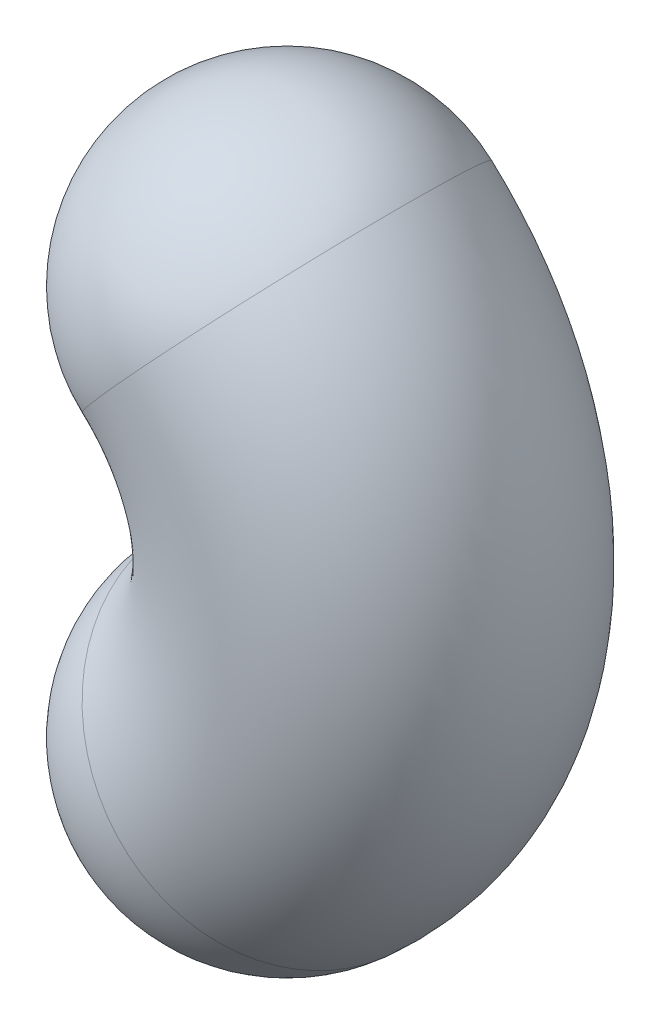
ISO-10303-21;
HEADER;
FILE_DESCRIPTION(('STEP AP214'),'2;1');
FILE_NAME('part.step','',(''),(''),'','','');
FILE_SCHEMA(('AUTOMOTIVE_DESIGN { 1 0 10303 214 1 1 1 1 }'));
ENDSEC;
DATA;
#1=APPLICATION_CONTEXT('core data for automotive mechanical design processes');
#2=APPLICATION_PROTOCOL_DEFINITION('international standard','automotive_design',2000,#1);
#3=PRODUCT_CONTEXT('',#1,'mechanical');
#4=PRODUCT('Part','Part','',(#3));
#5=PRODUCT_RELATED_PRODUCT_CATEGORY('part','',(#4));
#6=PRODUCT_DEFINITION_FORMATION('','',#4);
#7=PRODUCT_DEFINITION_CONTEXT('part definition',#1,'design');
#8=PRODUCT_DEFINITION('design','',#6,#7);
#9=PRODUCT_DEFINITION_SHAPE('','',#8);
#10=(LENGTH_UNIT() NAMED_UNIT(*) SI_UNIT(.MILLI.,.METRE.));
#11=(NAMED_UNIT(*) PLANE_ANGLE_UNIT() SI_UNIT($,.RADIAN.));
#12=(NAMED_UNIT(*) SI_UNIT($,.STERADIAN.) SOLID_ANGLE_UNIT());
#13=UNCERTAINTY_MEASURE_WITH_UNIT(LENGTH_MEASURE(1.E-05),#10,'distance_accuracy_value','');
#14=(GEOMETRIC_REPRESENTATION_CONTEXT(3) GLOBAL_UNCERTAINTY_ASSIGNED_CONTEXT((#13)) GLOBAL_UNIT_ASSIGNED_CONTEXT((#10,
#11,#12)) REPRESENTATION_CONTEXT('',''));
#15=CARTESIAN_POINT('',(0.,0.,0.));
#16=DIRECTION('',(0.,0.,1.));
#17=DIRECTION('',(1.,0.,0.));
#18=AXIS2_PLACEMENT_3D('',#15,#16,#17);
#19=CARTESIAN_POINT('',(-20.989117872179,-0.784354984557714,0.));
#20=DIRECTION('',(0.,0.,-1.));
#21=DIRECTION('',(-1.,0.,0.));
#22=AXIS2_PLACEMENT_3D('',#19,#20,#21);
#23=TOROIDAL_SURFACE('',#22,46.5232371870255,30.);
#24=CARTESIAN_POINT('',(10.2620757534718,33.6797494624217,0.));
#25=DIRECTION('',(0.740793343946213,-0.671732998716743,0.));
#26=DIRECTION('',(0.671732998716743,0.740793343946213,0.));
#27=AXIS2_PLACEMENT_3D('',#24,#25,#26);
#28=CIRCLE('',#27,30.);
#29=CARTESIAN_POINT('',(30.4140657149741,55.9035497808081,0.));
#30=VERTEX_POINT('',#29);
#31=EDGE_CURVE('E53',#30,#30,#28,.T.);
#32=CARTESIAN_POINT('',(10.2620757534719,-35.2484594315371,0.));
#33=DIRECTION('',(-0.740793343946213,-0.671732998716743,0.));
#34=DIRECTION('',(0.671732998716743,-0.740793343946213,0.));
#35=AXIS2_PLACEMENT_3D('',#32,#33,#34);
#36=CIRCLE('',#35,30.);
#37=CARTESIAN_POINT('',(30.4140657149742,-57.4722597499235,0.));
#38=VERTEX_POINT('',#37);
#39=EDGE_CURVE('E11',#38,#38,#36,.F.);
#40=CARTESIAN_POINT('',(-20.989117872179,-0.784354984557714,0.));
#41=DIRECTION('',(0.,0.,-1.));
#42=DIRECTION('',(-1.,0.,0.));
#43=AXIS2_PLACEMENT_3D('',#40,#41,#42);
#44=CIRCLE('',#43,76.5232371870255);
#45=EDGE_CURVE('',#30,#38,#44,.T.);
#46=ORIENTED_EDGE('',*,*,#31,.T.);
#47=ORIENTED_EDGE('',*,*,#39,.T.);
#48=ORIENTED_EDGE('',*,*,#45,.T.);
#49=ORIENTED_EDGE('',*,*,#45,.F.);
#50=EDGE_LOOP('',(#46,#48,#47,#49));
#51=FACE_BOUND('',#50,.T.);
#52=ADVANCED_FACE('F46',(#51),#23,.T.);
#53=CARTESIAN_POINT('',(10.2620757534719,33.6797494624217,0.));
#54=DIRECTION('',(0.999361643820474,-0.035725409171058,0.));
#55=DIRECTION('',(0.035725409171058,0.999361643820474,0.));
#56=AXIS2_PLACEMENT_3D('',#53,#54,#55);
#57=SPHERICAL_SURFACE('',#56,30.);
#58=CARTESIAN_POINT('',(10.2620757534719,33.6797494624217,0.));
#59=DIRECTION('',(0.740793343946213,-0.671732998716743,0.));
#60=DIRECTION('',(0.671732998716743,0.740793343946213,0.));
#61=AXIS2_PLACEMENT_3D('',#58,#59,#60);
#62=SPHERICAL_SURFACE('',#61,30.);
#63=ORIENTED_EDGE('',*,*,#31,.F.);
#64=EDGE_LOOP('',(#63));
#65=FACE_BOUND('',#64,.T.);
#66=ADVANCED_FACE('F60',(#65),#62,.T.);
#67=CARTESIAN_POINT('',(10.2620757534719,-35.2484594315371,0.));
#68=DIRECTION('',(-0.999361643820474,-0.0357254091710581,0.));
#69=DIRECTION('',(0.0357254091710581,-0.999361643820474,0.));
#70=AXIS2_PLACEMENT_3D('',#67,#68,#69);
#71=SPHERICAL_SURFACE('',#70,30.);
#72=CARTESIAN_POINT('',(10.2620757534719,-35.2484594315371,0.));
#73=DIRECTION('',(-0.740793343946213,-0.671732998716743,0.));
#74=DIRECTION('',(0.671732998716743,-0.740793343946213,0.));
#75=AXIS2_PLACEMENT_3D('',#72,#73,#74);
#76=SPHERICAL_SURFACE('',#75,30.);
#77=ORIENTED_EDGE('',*,*,#39,.F.);
#78=EDGE_LOOP('',(#77));
#79=FACE_BOUND('',#78,.T.);
#80=ADVANCED_FACE('F48',(#79),#76,.T.);
#81=CLOSED_SHELL('',(#52,#66,#80));
#82=MANIFOLD_SOLID_BREP('B2',#81);
#83=ADVANCED_BREP_SHAPE_REPRESENTATION('',(#18,#82),#14);
#84=SHAPE_DEFINITION_REPRESENTATION(#9,#83);
ENDSEC;
END-ISO-10303-21;
